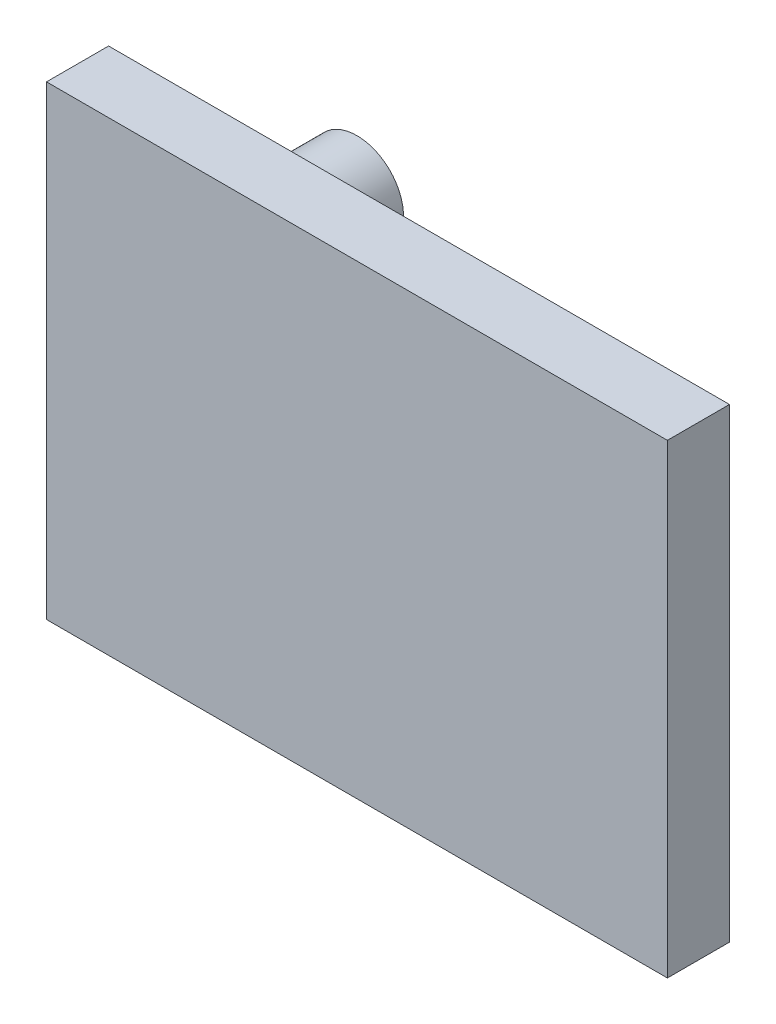
ISO-10303-21;
HEADER;
FILE_DESCRIPTION(('STEP AP214'),'2;1');
FILE_NAME('part.step','',(''),(''),'','','');
FILE_SCHEMA(('AUTOMOTIVE_DESIGN { 1 0 10303 214 1 1 1 1 }'));
ENDSEC;
DATA;
#1=APPLICATION_CONTEXT('core data for automotive mechanical design processes');
#2=APPLICATION_PROTOCOL_DEFINITION('international standard','automotive_design',2000,#1);
#3=PRODUCT_CONTEXT('',#1,'mechanical');
#4=PRODUCT('Part','Part','',(#3));
#5=PRODUCT_RELATED_PRODUCT_CATEGORY('part','',(#4));
#6=PRODUCT_DEFINITION_FORMATION('','',#4);
#7=PRODUCT_DEFINITION_CONTEXT('part definition',#1,'design');
#8=PRODUCT_DEFINITION('design','',#6,#7);
#9=PRODUCT_DEFINITION_SHAPE('','',#8);
#10=(LENGTH_UNIT() NAMED_UNIT(*) SI_UNIT(.MILLI.,.METRE.));
#11=(NAMED_UNIT(*) PLANE_ANGLE_UNIT() SI_UNIT($,.RADIAN.));
#12=(NAMED_UNIT(*) SI_UNIT($,.STERADIAN.) SOLID_ANGLE_UNIT());
#13=UNCERTAINTY_MEASURE_WITH_UNIT(LENGTH_MEASURE(1.E-05),#10,'distance_accuracy_value','');
#14=(GEOMETRIC_REPRESENTATION_CONTEXT(3) GLOBAL_UNCERTAINTY_ASSIGNED_CONTEXT((#13)) GLOBAL_UNIT_ASSIGNED_CONTEXT((#10,
#11,#12)) REPRESENTATION_CONTEXT('',''));
#15=CARTESIAN_POINT('',(0.,0.,0.));
#16=DIRECTION('',(0.,0.,1.));
#17=DIRECTION('',(1.,0.,0.));
#18=AXIS2_PLACEMENT_3D('',#15,#16,#17);
#19=CARTESIAN_POINT('',(100.,-75.,20.));
#20=DIRECTION('',(-1.,0.,0.));
#21=DIRECTION('',(0.,0.,1.));
#22=AXIS2_PLACEMENT_3D('',#19,#20,#21);
#23=PLANE('',#22);
#24=DIRECTION('',(0.,1.,0.));
#25=VECTOR('',#24,1.);
#26=CARTESIAN_POINT('',(100.,-75.,0.));
#27=LINE('',#26,#25);
#28=CARTESIAN_POINT('',(100.,-75.,0.));
#29=VERTEX_POINT('',#28);
#30=CARTESIAN_POINT('',(100.,75.,0.));
#31=VERTEX_POINT('',#30);
#32=EDGE_CURVE('E96',#29,#31,#27,.T.);
#33=ORIENTED_EDGE('',*,*,#32,.T.);
#34=DIRECTION('',(0.,0.,-1.));
#35=VECTOR('',#34,1.);
#36=CARTESIAN_POINT('',(100.,75.,20.));
#37=LINE('',#36,#35);
#38=CARTESIAN_POINT('',(100.,75.,20.));
#39=VERTEX_POINT('',#38);
#40=EDGE_CURVE('E11',#39,#31,#37,.T.);
#41=ORIENTED_EDGE('',*,*,#40,.F.);
#42=DIRECTION('',(0.,1.,0.));
#43=VECTOR('',#42,1.);
#44=CARTESIAN_POINT('',(100.,-75.,20.));
#45=LINE('',#44,#43);
#46=CARTESIAN_POINT('',(100.,-75.,20.));
#47=VERTEX_POINT('',#46);
#48=EDGE_CURVE('E84',#47,#39,#45,.T.);
#49=ORIENTED_EDGE('',*,*,#48,.F.);
#50=DIRECTION('',(0.,0.,-1.));
#51=VECTOR('',#50,1.);
#52=CARTESIAN_POINT('',(100.,-75.,20.));
#53=LINE('',#52,#51);
#54=EDGE_CURVE('E92',#47,#29,#53,.T.);
#55=ORIENTED_EDGE('',*,*,#54,.T.);
#56=EDGE_LOOP('',(#33,#41,#49,#55));
#57=FACE_BOUND('',#56,.T.);
#58=ADVANCED_FACE('F33',(#57),#23,.F.);
#59=CARTESIAN_POINT('',(-100.,75.,20.));
#60=DIRECTION('',(0.,-1.,0.));
#61=DIRECTION('',(0.,0.,-1.));
#62=AXIS2_PLACEMENT_3D('',#59,#60,#61);
#63=PLANE('',#62);
#64=DIRECTION('',(-1.,0.,0.));
#65=VECTOR('',#64,1.);
#66=CARTESIAN_POINT('',(-100.,75.,0.));
#67=LINE('',#66,#65);
#68=CARTESIAN_POINT('',(-100.,75.,0.));
#69=VERTEX_POINT('',#68);
#70=EDGE_CURVE('E88',#31,#69,#67,.T.);
#71=ORIENTED_EDGE('',*,*,#70,.T.);
#72=DIRECTION('',(0.,0.,-1.));
#73=VECTOR('',#72,1.);
#74=CARTESIAN_POINT('',(-100.,75.,20.));
#75=LINE('',#74,#73);
#76=CARTESIAN_POINT('',(-100.,75.,20.));
#77=VERTEX_POINT('',#76);
#78=EDGE_CURVE('E41',#77,#69,#75,.T.);
#79=ORIENTED_EDGE('',*,*,#78,.F.);
#80=DIRECTION('',(-1.,0.,0.));
#81=VECTOR('',#80,1.);
#82=CARTESIAN_POINT('',(-100.,75.,20.));
#83=LINE('',#82,#81);
#84=EDGE_CURVE('E79',#39,#77,#83,.T.);
#85=ORIENTED_EDGE('',*,*,#84,.F.);
#86=ORIENTED_EDGE('',*,*,#40,.T.);
#87=EDGE_LOOP('',(#71,#79,#85,#86));
#88=FACE_BOUND('',#87,.T.);
#89=ADVANCED_FACE('F87',(#88),#63,.F.);
#90=CARTESIAN_POINT('',(-100.,-75.,20.));
#91=DIRECTION('',(1.,0.,0.));
#92=DIRECTION('',(0.,0.,-1.));
#93=AXIS2_PLACEMENT_3D('',#90,#91,#92);
#94=PLANE('',#93);
#95=DIRECTION('',(0.,-1.,0.));
#96=VECTOR('',#95,1.);
#97=CARTESIAN_POINT('',(-100.,-75.,0.));
#98=LINE('',#97,#96);
#99=CARTESIAN_POINT('',(-100.,-75.,0.));
#100=VERTEX_POINT('',#99);
#101=EDGE_CURVE('E66',#69,#100,#98,.T.);
#102=ORIENTED_EDGE('',*,*,#101,.T.);
#103=DIRECTION('',(0.,0.,-1.));
#104=VECTOR('',#103,1.);
#105=CARTESIAN_POINT('',(-100.,-75.,20.));
#106=LINE('',#105,#104);
#107=CARTESIAN_POINT('',(-100.,-75.,20.));
#108=VERTEX_POINT('',#107);
#109=EDGE_CURVE('E89',#108,#100,#106,.T.);
#110=ORIENTED_EDGE('',*,*,#109,.F.);
#111=DIRECTION('',(0.,-1.,0.));
#112=VECTOR('',#111,1.);
#113=CARTESIAN_POINT('',(-100.,-75.,20.));
#114=LINE('',#113,#112);
#115=EDGE_CURVE('E82',#77,#108,#114,.T.);
#116=ORIENTED_EDGE('',*,*,#115,.F.);
#117=ORIENTED_EDGE('',*,*,#78,.T.);
#118=EDGE_LOOP('',(#102,#110,#116,#117));
#119=FACE_BOUND('',#118,.T.);
#120=ADVANCED_FACE('F90',(#119),#94,.F.);
#121=CARTESIAN_POINT('',(-100.,-75.,20.));
#122=DIRECTION('',(0.,1.,0.));
#123=DIRECTION('',(0.,0.,1.));
#124=AXIS2_PLACEMENT_3D('',#121,#122,#123);
#125=PLANE('',#124);
#126=DIRECTION('',(1.,0.,0.));
#127=VECTOR('',#126,1.);
#128=CARTESIAN_POINT('',(-100.,-75.,0.));
#129=LINE('',#128,#127);
#130=EDGE_CURVE('E72',#100,#29,#129,.T.);
#131=ORIENTED_EDGE('',*,*,#130,.T.);
#132=ORIENTED_EDGE('',*,*,#54,.F.);
#133=DIRECTION('',(1.,0.,0.));
#134=VECTOR('',#133,1.);
#135=CARTESIAN_POINT('',(-100.,-75.,20.));
#136=LINE('',#135,#134);
#137=EDGE_CURVE('E49',#108,#47,#136,.T.);
#138=ORIENTED_EDGE('',*,*,#137,.F.);
#139=ORIENTED_EDGE('',*,*,#109,.T.);
#140=EDGE_LOOP('',(#131,#132,#138,#139));
#141=FACE_BOUND('',#140,.T.);
#142=ADVANCED_FACE('F104',(#141),#125,.F.);
#143=CARTESIAN_POINT('',(0.,0.,20.));
#144=DIRECTION('',(0.,0.,-1.));
#145=DIRECTION('',(-1.,0.,0.));
#146=AXIS2_PLACEMENT_3D('',#143,#144,#145);
#147=PLANE('',#146);
#148=ORIENTED_EDGE('',*,*,#48,.T.);
#149=ORIENTED_EDGE('',*,*,#84,.T.);
#150=ORIENTED_EDGE('',*,*,#115,.T.);
#151=ORIENTED_EDGE('',*,*,#137,.T.);
#152=EDGE_LOOP('',(#148,#149,#150,#151));
#153=FACE_BOUND('',#152,.T.);
#154=ADVANCED_FACE('F80',(#153),#147,.F.);
#155=CARTESIAN_POINT('',(0.,0.,0.));
#156=DIRECTION('',(0.,0.,-1.));
#157=DIRECTION('',(-1.,0.,0.));
#158=AXIS2_PLACEMENT_3D('',#155,#156,#157);
#159=PLANE('',#158);
#160=CARTESIAN_POINT('',(-50.,45.,0.));
#161=DIRECTION('',(0.,0.,-1.));
#162=DIRECTION('',(-1.,0.,0.));
#163=AXIS2_PLACEMENT_3D('',#160,#161,#162);
#164=CIRCLE('',#163,15.);
#165=CARTESIAN_POINT('',(-65.,45.,0.));
#166=VERTEX_POINT('',#165);
#167=EDGE_CURVE('E116',#166,#166,#164,.T.);
#168=ORIENTED_EDGE('',*,*,#167,.F.);
#169=EDGE_LOOP('',(#168));
#170=FACE_BOUND('',#169,.T.);
#171=CARTESIAN_POINT('',(50.,-45.,0.));
#172=DIRECTION('',(0.,0.,-1.));
#173=DIRECTION('',(-1.,0.,0.));
#174=AXIS2_PLACEMENT_3D('',#171,#172,#173);
#175=CIRCLE('',#174,10.);
#176=CARTESIAN_POINT('',(40.,-45.,0.));
#177=VERTEX_POINT('',#176);
#178=EDGE_CURVE('E110',#177,#177,#175,.T.);
#179=ORIENTED_EDGE('',*,*,#178,.F.);
#180=EDGE_LOOP('',(#179));
#181=FACE_BOUND('',#180,.T.);
#182=ORIENTED_EDGE('',*,*,#32,.F.);
#183=ORIENTED_EDGE('',*,*,#130,.F.);
#184=ORIENTED_EDGE('',*,*,#101,.F.);
#185=ORIENTED_EDGE('',*,*,#70,.F.);
#186=EDGE_LOOP('',(#182,#183,#184,#185));
#187=FACE_BOUND('',#186,.T.);
#188=ADVANCED_FACE('F107',(#170,#181,#187),#159,.T.);
#189=CARTESIAN_POINT('',(50.,-45.,-30.));
#190=DIRECTION('',(0.,0.,1.));
#191=DIRECTION('',(1.,0.,0.));
#192=AXIS2_PLACEMENT_3D('',#189,#190,#191);
#193=CYLINDRICAL_SURFACE('',#192,10.);
#194=CARTESIAN_POINT('',(50.,-45.,-30.));
#195=DIRECTION('',(0.,0.,-1.));
#196=DIRECTION('',(-1.,0.,0.));
#197=AXIS2_PLACEMENT_3D('',#194,#195,#196);
#198=CIRCLE('',#197,10.);
#199=CARTESIAN_POINT('',(40.,-45.,-30.));
#200=VERTEX_POINT('',#199);
#201=EDGE_CURVE('E99',#200,#200,#198,.T.);
#202=ORIENTED_EDGE('',*,*,#201,.F.);
#203=EDGE_LOOP('',(#202));
#204=FACE_BOUND('',#203,.T.);
#205=ORIENTED_EDGE('',*,*,#178,.T.);
#206=EDGE_LOOP('',(#205));
#207=FACE_BOUND('',#206,.T.);
#208=ADVANCED_FACE('F133',(#204,#207),#193,.T.);
#209=CARTESIAN_POINT('',(50.,-45.,-30.));
#210=DIRECTION('',(0.,0.,-1.));
#211=DIRECTION('',(-1.,0.,0.));
#212=AXIS2_PLACEMENT_3D('',#209,#210,#211);
#213=PLANE('',#212);
#214=ORIENTED_EDGE('',*,*,#201,.T.);
#215=EDGE_LOOP('',(#214));
#216=FACE_BOUND('',#215,.T.);
#217=ADVANCED_FACE('F127',(#216),#213,.T.);
#218=CARTESIAN_POINT('',(-50.,45.,-30.));
#219=DIRECTION('',(0.,0.,1.));
#220=DIRECTION('',(1.,0.,0.));
#221=AXIS2_PLACEMENT_3D('',#218,#219,#220);
#222=CYLINDRICAL_SURFACE('',#221,15.);
#223=CARTESIAN_POINT('',(-50.,45.,-30.));
#224=DIRECTION('',(0.,0.,-1.));
#225=DIRECTION('',(-1.,0.,0.));
#226=AXIS2_PLACEMENT_3D('',#223,#224,#225);
#227=CIRCLE('',#226,15.);
#228=CARTESIAN_POINT('',(-65.,45.,-30.));
#229=VERTEX_POINT('',#228);
#230=EDGE_CURVE('E113',#229,#229,#227,.T.);
#231=ORIENTED_EDGE('',*,*,#230,.F.);
#232=EDGE_LOOP('',(#231));
#233=FACE_BOUND('',#232,.T.);
#234=ORIENTED_EDGE('',*,*,#167,.T.);
#235=EDGE_LOOP('',(#234));
#236=FACE_BOUND('',#235,.T.);
#237=ADVANCED_FACE('F124',(#233,#236),#222,.T.);
#238=CARTESIAN_POINT('',(-50.,45.,-30.));
#239=DIRECTION('',(0.,0.,-1.));
#240=DIRECTION('',(-1.,0.,0.));
#241=AXIS2_PLACEMENT_3D('',#238,#239,#240);
#242=PLANE('',#241);
#243=ORIENTED_EDGE('',*,*,#230,.T.);
#244=EDGE_LOOP('',(#243));
#245=FACE_BOUND('',#244,.T.);
#246=ADVANCED_FACE('F122',(#245),#242,.T.);
#247=CLOSED_SHELL('',(#58,#89,#120,#142,#154,#188,#208,#217,#237,#246));
#248=MANIFOLD_SOLID_BREP('B2',#247);
#249=ADVANCED_BREP_SHAPE_REPRESENTATION('',(#18,#248),#14);
#250=SHAPE_DEFINITION_REPRESENTATION(#9,#249);
ENDSEC;
END-ISO-10303-21;
